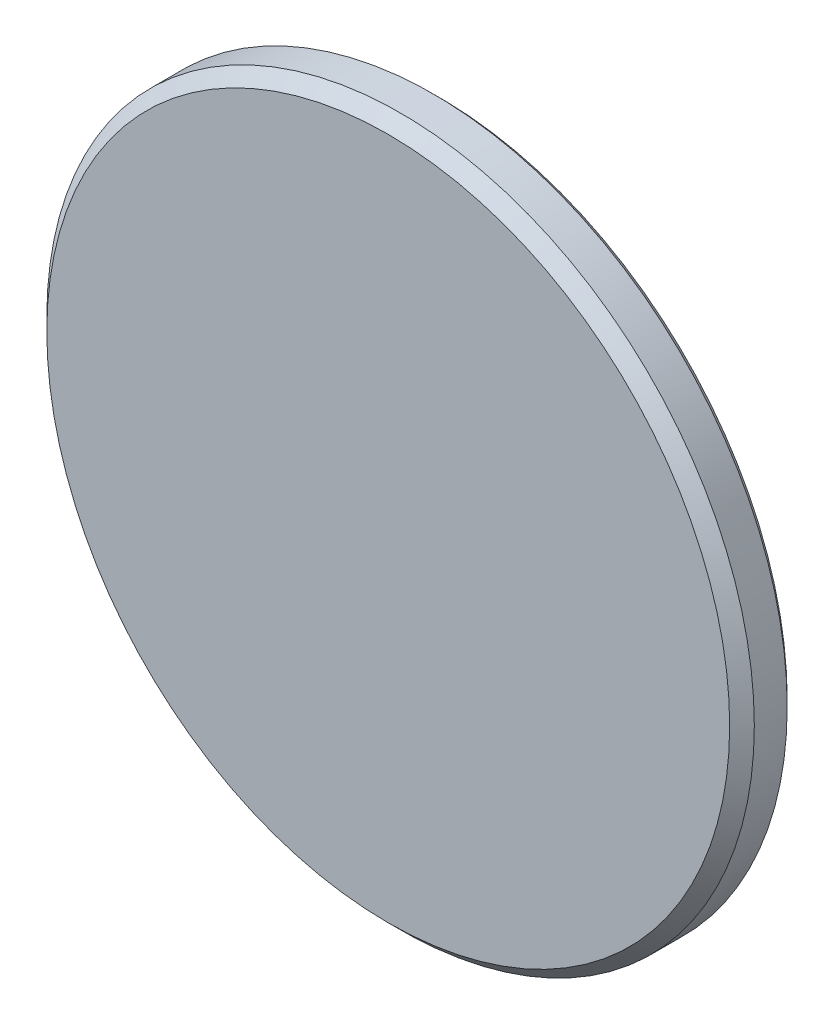
ISO-10303-21;
HEADER;
FILE_DESCRIPTION(('STEP AP214'),'2;1');
FILE_NAME('part.step','',(''),(''),'','','');
FILE_SCHEMA(('AUTOMOTIVE_DESIGN { 1 0 10303 214 1 1 1 1 }'));
ENDSEC;
DATA;
#1=APPLICATION_CONTEXT('core data for automotive mechanical design processes');
#2=APPLICATION_PROTOCOL_DEFINITION('international standard','automotive_design',2000,#1);
#3=PRODUCT_CONTEXT('',#1,'mechanical');
#4=PRODUCT('Part','Part','',(#3));
#5=PRODUCT_RELATED_PRODUCT_CATEGORY('part','',(#4));
#6=PRODUCT_DEFINITION_FORMATION('','',#4);
#7=PRODUCT_DEFINITION_CONTEXT('part definition',#1,'design');
#8=PRODUCT_DEFINITION('design','',#6,#7);
#9=PRODUCT_DEFINITION_SHAPE('','',#8);
#10=(LENGTH_UNIT() NAMED_UNIT(*) SI_UNIT(.MILLI.,.METRE.));
#11=(NAMED_UNIT(*) PLANE_ANGLE_UNIT() SI_UNIT($,.RADIAN.));
#12=(NAMED_UNIT(*) SI_UNIT($,.STERADIAN.) SOLID_ANGLE_UNIT());
#13=UNCERTAINTY_MEASURE_WITH_UNIT(LENGTH_MEASURE(1.E-05),#10,'distance_accuracy_value','');
#14=(GEOMETRIC_REPRESENTATION_CONTEXT(3) GLOBAL_UNCERTAINTY_ASSIGNED_CONTEXT((#13)) GLOBAL_UNIT_ASSIGNED_CONTEXT((#10,
#11,#12)) REPRESENTATION_CONTEXT('',''));
#15=CARTESIAN_POINT('',(0.,0.,0.));
#16=DIRECTION('',(0.,0.,1.));
#17=DIRECTION('',(1.,0.,0.));
#18=AXIS2_PLACEMENT_3D('',#15,#16,#17);
#19=CARTESIAN_POINT('',(0.,0.,0.380999999999979));
#20=DIRECTION('',(0.,0.,1.));
#21=DIRECTION('',(1.,0.,0.));
#22=AXIS2_PLACEMENT_3D('',#19,#20,#21);
#23=CONICAL_SURFACE('',#22,21.8694,0.785398163397448);
#24=CARTESIAN_POINT('',(0.,0.,0.));
#25=DIRECTION('',(0.,0.,1.));
#26=DIRECTION('',(1.,0.,0.));
#27=AXIS2_PLACEMENT_3D('',#24,#25,#26);
#28=CIRCLE('',#27,21.4884);
#29=CARTESIAN_POINT('',(21.4884,0.,0.));
#30=VERTEX_POINT('',#29);
#31=EDGE_CURVE('E44',#30,#30,#28,.T.);
#32=ORIENTED_EDGE('',*,*,#31,.T.);
#33=EDGE_LOOP('',(#32));
#34=FACE_BOUND('',#33,.T.);
#35=CARTESIAN_POINT('',(0.,0.,0.380999999999979));
#36=DIRECTION('',(0.,0.,1.));
#37=DIRECTION('',(1.,0.,0.));
#38=AXIS2_PLACEMENT_3D('',#35,#36,#37);
#39=CIRCLE('',#38,21.8694);
#40=CARTESIAN_POINT('',(21.8694,0.,0.380999999999979));
#41=VERTEX_POINT('',#40);
#42=EDGE_CURVE('E10',#41,#41,#39,.T.);
#43=ORIENTED_EDGE('',*,*,#42,.F.);
#44=EDGE_LOOP('',(#43));
#45=FACE_BOUND('',#44,.T.);
#46=ADVANCED_FACE('F30',(#34,#45),#23,.T.);
#47=CARTESIAN_POINT('',(0.,0.,0.));
#48=DIRECTION('',(0.,0.,1.));
#49=DIRECTION('',(1.,0.,0.));
#50=AXIS2_PLACEMENT_3D('',#47,#48,#49);
#51=CYLINDRICAL_SURFACE('',#50,21.8694);
#52=ORIENTED_EDGE('',*,*,#42,.T.);
#53=EDGE_LOOP('',(#52));
#54=FACE_BOUND('',#53,.T.);
#55=CARTESIAN_POINT('',(0.,0.,2.41299999999999));
#56=DIRECTION('',(0.,0.,1.));
#57=DIRECTION('',(1.,0.,0.));
#58=AXIS2_PLACEMENT_3D('',#55,#56,#57);
#59=CIRCLE('',#58,21.8694);
#60=CARTESIAN_POINT('',(21.8694,0.,2.41299999999999));
#61=VERTEX_POINT('',#60);
#62=EDGE_CURVE('E36',#61,#61,#59,.T.);
#63=ORIENTED_EDGE('',*,*,#62,.F.);
#64=EDGE_LOOP('',(#63));
#65=FACE_BOUND('',#64,.T.);
#66=ADVANCED_FACE('F63',(#54,#65),#51,.T.);
#67=CARTESIAN_POINT('',(0.,0.,3.17500000000001));
#68=DIRECTION('',(0.,0.,-1.));
#69=DIRECTION('',(-1.,0.,0.));
#70=AXIS2_PLACEMENT_3D('',#67,#68,#69);
#71=CONICAL_SURFACE('',#70,21.1074,0.785398163397446);
#72=ORIENTED_EDGE('',*,*,#62,.T.);
#73=EDGE_LOOP('',(#72));
#74=FACE_BOUND('',#73,.T.);
#75=CARTESIAN_POINT('',(0.,0.,3.17500000000001));
#76=DIRECTION('',(0.,0.,1.));
#77=DIRECTION('',(1.,0.,0.));
#78=AXIS2_PLACEMENT_3D('',#75,#76,#77);
#79=CIRCLE('',#78,21.1074);
#80=CARTESIAN_POINT('',(21.1074,0.,3.17500000000001));
#81=VERTEX_POINT('',#80);
#82=EDGE_CURVE('E40',#81,#81,#79,.T.);
#83=ORIENTED_EDGE('',*,*,#82,.F.);
#84=EDGE_LOOP('',(#83));
#85=FACE_BOUND('',#84,.T.);
#86=ADVANCED_FACE('F59',(#74,#85),#71,.T.);
#87=CARTESIAN_POINT('',(0.,0.,3.175));
#88=DIRECTION('',(0.,0.,1.));
#89=DIRECTION('',(1.,0.,0.));
#90=AXIS2_PLACEMENT_3D('',#87,#88,#89);
#91=PLANE('',#90);
#92=ORIENTED_EDGE('',*,*,#82,.T.);
#93=EDGE_LOOP('',(#92));
#94=FACE_BOUND('',#93,.T.);
#95=ADVANCED_FACE('F54',(#94),#91,.T.);
#96=CARTESIAN_POINT('',(21.4884,0.,0.));
#97=DIRECTION('',(0.,0.,-1.));
#98=DIRECTION('',(-1.,0.,0.));
#99=AXIS2_PLACEMENT_3D('',#96,#97,#98);
#100=PLANE('',#99);
#101=ORIENTED_EDGE('',*,*,#31,.F.);
#102=EDGE_LOOP('',(#101));
#103=FACE_BOUND('',#102,.T.);
#104=ADVANCED_FACE('F52',(#103),#100,.T.);
#105=CLOSED_SHELL('',(#46,#66,#86,#95,#104));
#106=MANIFOLD_SOLID_BREP('B2',#105);
#107=ADVANCED_BREP_SHAPE_REPRESENTATION('',(#18,#106),#14);
#108=SHAPE_DEFINITION_REPRESENTATION(#9,#107);
ENDSEC;
END-ISO-10303-21;
